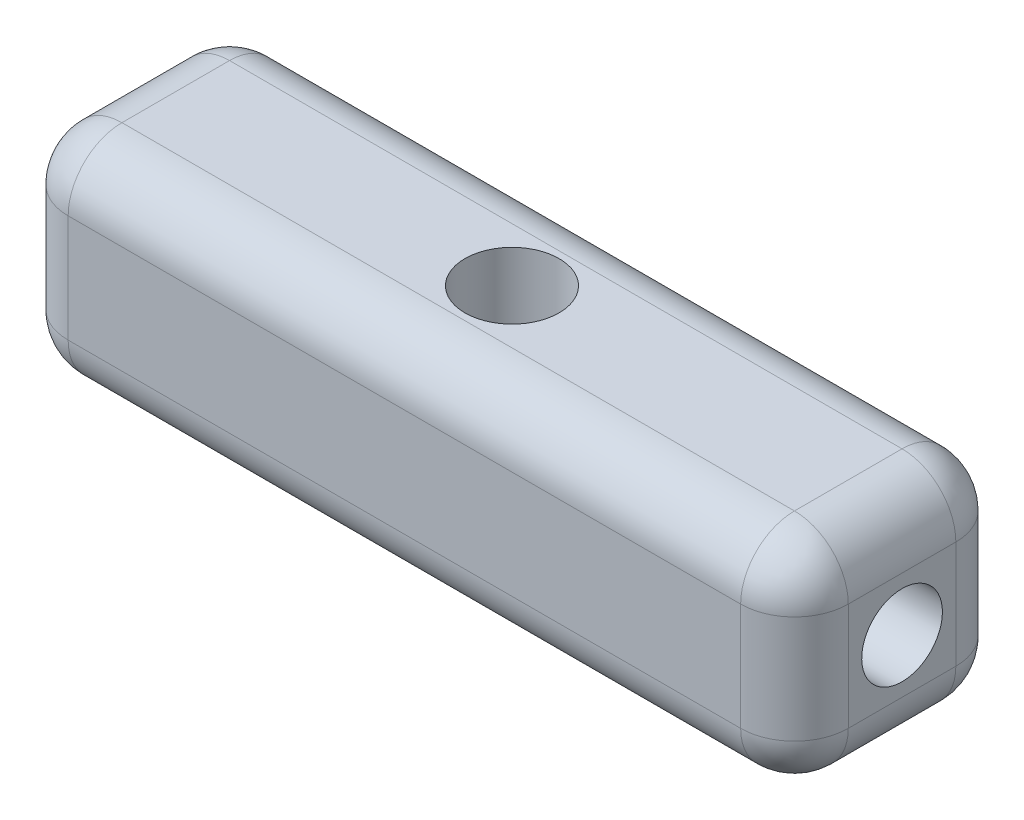
ISO-10303-21;
HEADER;
FILE_DESCRIPTION(('STEP AP214'),'2;1');
FILE_NAME('part.step','',(''),(''),'','','');
FILE_SCHEMA(('AUTOMOTIVE_DESIGN { 1 0 10303 214 1 1 1 1 }'));
ENDSEC;
DATA;
#1=APPLICATION_CONTEXT('core data for automotive mechanical design processes');
#2=APPLICATION_PROTOCOL_DEFINITION('international standard','automotive_design',2000,#1);
#3=PRODUCT_CONTEXT('',#1,'mechanical');
#4=PRODUCT('Part','Part','',(#3));
#5=PRODUCT_RELATED_PRODUCT_CATEGORY('part','',(#4));
#6=PRODUCT_DEFINITION_FORMATION('','',#4);
#7=PRODUCT_DEFINITION_CONTEXT('part definition',#1,'design');
#8=PRODUCT_DEFINITION('design','',#6,#7);
#9=PRODUCT_DEFINITION_SHAPE('','',#8);
#10=(LENGTH_UNIT() NAMED_UNIT(*) SI_UNIT(.MILLI.,.METRE.));
#11=(NAMED_UNIT(*) PLANE_ANGLE_UNIT() SI_UNIT($,.RADIAN.));
#12=(NAMED_UNIT(*) SI_UNIT($,.STERADIAN.) SOLID_ANGLE_UNIT());
#13=UNCERTAINTY_MEASURE_WITH_UNIT(LENGTH_MEASURE(1.E-05),#10,'distance_accuracy_value','');
#14=(GEOMETRIC_REPRESENTATION_CONTEXT(3) GLOBAL_UNCERTAINTY_ASSIGNED_CONTEXT((#13)) GLOBAL_UNIT_ASSIGNED_CONTEXT((#10,
#11,#12)) REPRESENTATION_CONTEXT('',''));
#15=CARTESIAN_POINT('',(0.,0.,0.));
#16=DIRECTION('',(0.,0.,1.));
#17=DIRECTION('',(1.,0.,0.));
#18=AXIS2_PLACEMENT_3D('',#15,#16,#17);
#19=CARTESIAN_POINT('',(0.,0.,8.));
#20=DIRECTION('',(1.,0.,0.));
#21=DIRECTION('',(0.,0.,-1.));
#22=AXIS2_PLACEMENT_3D('',#19,#20,#21);
#23=PLANE('',#22);
#24=CARTESIAN_POINT('',(0.,4.,4.));
#25=DIRECTION('',(-1.,0.,0.));
#26=DIRECTION('',(0.,0.,1.));
#27=AXIS2_PLACEMENT_3D('',#24,#25,#26);
#28=CIRCLE('',#27,1.5);
#29=CARTESIAN_POINT('',(0.,4.,5.5));
#30=VERTEX_POINT('',#29);
#31=EDGE_CURVE('E665',#30,#30,#28,.T.);
#32=ORIENTED_EDGE('',*,*,#31,.F.);
#33=EDGE_LOOP('',(#32));
#34=FACE_BOUND('',#33,.T.);
#35=DIRECTION('',(0.,-1.,0.));
#36=VECTOR('',#35,1.);
#37=CARTESIAN_POINT('',(0.,0.,2.));
#38=LINE('',#37,#36);
#39=CARTESIAN_POINT('',(0.,6.,2.));
#40=VERTEX_POINT('',#39);
#41=CARTESIAN_POINT('',(0.,2.,2.));
#42=VERTEX_POINT('',#41);
#43=EDGE_CURVE('E207',#40,#42,#38,.T.);
#44=ORIENTED_EDGE('',*,*,#43,.T.);
#45=DIRECTION('',(0.,0.,-1.));
#46=VECTOR('',#45,1.);
#47=CARTESIAN_POINT('',(0.,2.,8.));
#48=LINE('',#47,#46);
#49=CARTESIAN_POINT('',(0.,2.,6.));
#50=VERTEX_POINT('',#49);
#51=EDGE_CURVE('E12',#42,#50,#48,.F.);
#52=ORIENTED_EDGE('',*,*,#51,.T.);
#53=DIRECTION('',(0.,-1.,0.));
#54=VECTOR('',#53,1.);
#55=CARTESIAN_POINT('',(0.,0.,6.));
#56=LINE('',#55,#54);
#57=CARTESIAN_POINT('',(0.,6.,6.));
#58=VERTEX_POINT('',#57);
#59=EDGE_CURVE('E49',#50,#58,#56,.F.);
#60=ORIENTED_EDGE('',*,*,#59,.T.);
#61=DIRECTION('',(0.,0.,-1.));
#62=VECTOR('',#61,1.);
#63=CARTESIAN_POINT('',(0.,6.,8.));
#64=LINE('',#63,#62);
#65=EDGE_CURVE('E209',#58,#40,#64,.T.);
#66=ORIENTED_EDGE('',*,*,#65,.T.);
#67=EDGE_LOOP('',(#44,#52,#60,#66));
#68=FACE_BOUND('',#67,.T.);
#69=ADVANCED_FACE('F40',(#34,#68),#23,.F.);
#70=CARTESIAN_POINT('',(0.,0.,8.));
#71=DIRECTION('',(0.,1.,0.));
#72=DIRECTION('',(0.,0.,1.));
#73=AXIS2_PLACEMENT_3D('',#70,#71,#72);
#74=PLANE('',#73);
#75=DIRECTION('',(0.,0.,-1.));
#76=VECTOR('',#75,1.);
#77=CARTESIAN_POINT('',(2.,0.,8.));
#78=LINE('',#77,#76);
#79=CARTESIAN_POINT('',(2.,0.,6.));
#80=VERTEX_POINT('',#79);
#81=CARTESIAN_POINT('',(2.,0.,2.));
#82=VERTEX_POINT('',#81);
#83=EDGE_CURVE('E171',#80,#82,#78,.T.);
#84=ORIENTED_EDGE('',*,*,#83,.T.);
#85=DIRECTION('',(1.,0.,0.));
#86=VECTOR('',#85,1.);
#87=CARTESIAN_POINT('',(29.,0.,2.));
#88=LINE('',#87,#86);
#89=CARTESIAN_POINT('',(27.,0.,2.));
#90=VERTEX_POINT('',#89);
#91=EDGE_CURVE('E178',#82,#90,#88,.T.);
#92=ORIENTED_EDGE('',*,*,#91,.T.);
#93=DIRECTION('',(0.,0.,-1.));
#94=VECTOR('',#93,1.);
#95=CARTESIAN_POINT('',(27.,0.,8.));
#96=LINE('',#95,#94);
#97=CARTESIAN_POINT('',(27.,0.,6.));
#98=VERTEX_POINT('',#97);
#99=EDGE_CURVE('E139',#90,#98,#96,.F.);
#100=ORIENTED_EDGE('',*,*,#99,.T.);
#101=DIRECTION('',(1.,0.,0.));
#102=VECTOR('',#101,1.);
#103=CARTESIAN_POINT('',(0.,0.,6.));
#104=LINE('',#103,#102);
#105=EDGE_CURVE('E169',#98,#80,#104,.F.);
#106=ORIENTED_EDGE('',*,*,#105,.T.);
#107=EDGE_LOOP('',(#84,#92,#100,#106));
#108=FACE_BOUND('',#107,.T.);
#109=CARTESIAN_POINT('',(14.5,0.,4.));
#110=DIRECTION('',(0.,1.,0.));
#111=DIRECTION('',(0.,0.,1.));
#112=AXIS2_PLACEMENT_3D('',#109,#110,#111);
#113=CIRCLE('',#112,1.75);
#114=CARTESIAN_POINT('',(14.5,0.,5.75));
#115=VERTEX_POINT('',#114);
#116=EDGE_CURVE('E163',#115,#115,#113,.T.);
#117=ORIENTED_EDGE('',*,*,#116,.T.);
#118=EDGE_LOOP('',(#117));
#119=FACE_BOUND('',#118,.T.);
#120=ADVANCED_FACE('F301',(#108,#119),#74,.F.);
#121=CARTESIAN_POINT('',(29.,0.,8.));
#122=DIRECTION('',(-1.,0.,0.));
#123=DIRECTION('',(0.,0.,1.));
#124=AXIS2_PLACEMENT_3D('',#121,#122,#123);
#125=PLANE('',#124);
#126=CARTESIAN_POINT('',(29.,4.,4.));
#127=DIRECTION('',(1.,0.,0.));
#128=DIRECTION('',(0.,1.,0.));
#129=AXIS2_PLACEMENT_3D('',#126,#127,#128);
#130=CIRCLE('',#129,1.5);
#131=CARTESIAN_POINT('',(29.,5.5,4.));
#132=VERTEX_POINT('',#131);
#133=EDGE_CURVE('E659',#132,#132,#130,.T.);
#134=ORIENTED_EDGE('',*,*,#133,.F.);
#135=EDGE_LOOP('',(#134));
#136=FACE_BOUND('',#135,.T.);
#137=DIRECTION('',(0.,1.,0.));
#138=VECTOR('',#137,1.);
#139=CARTESIAN_POINT('',(29.,0.,6.));
#140=LINE('',#139,#138);
#141=CARTESIAN_POINT('',(29.,6.,6.));
#142=VERTEX_POINT('',#141);
#143=CARTESIAN_POINT('',(29.,2.,6.));
#144=VERTEX_POINT('',#143);
#145=EDGE_CURVE('E167',#142,#144,#140,.F.);
#146=ORIENTED_EDGE('',*,*,#145,.T.);
#147=DIRECTION('',(0.,0.,-1.));
#148=VECTOR('',#147,1.);
#149=CARTESIAN_POINT('',(29.,2.,8.));
#150=LINE('',#149,#148);
#151=CARTESIAN_POINT('',(29.,2.,2.));
#152=VERTEX_POINT('',#151);
#153=EDGE_CURVE('E137',#144,#152,#150,.T.);
#154=ORIENTED_EDGE('',*,*,#153,.T.);
#155=DIRECTION('',(0.,1.,0.));
#156=VECTOR('',#155,1.);
#157=CARTESIAN_POINT('',(29.,8.,2.));
#158=LINE('',#157,#156);
#159=CARTESIAN_POINT('',(29.,6.,2.));
#160=VERTEX_POINT('',#159);
#161=EDGE_CURVE('E156',#152,#160,#158,.T.);
#162=ORIENTED_EDGE('',*,*,#161,.T.);
#163=DIRECTION('',(0.,0.,-1.));
#164=VECTOR('',#163,1.);
#165=CARTESIAN_POINT('',(29.,6.,8.));
#166=LINE('',#165,#164);
#167=EDGE_CURVE('E162',#160,#142,#166,.F.);
#168=ORIENTED_EDGE('',*,*,#167,.T.);
#169=EDGE_LOOP('',(#146,#154,#162,#168));
#170=FACE_BOUND('',#169,.T.);
#171=ADVANCED_FACE('F165',(#136,#170),#125,.F.);
#172=CARTESIAN_POINT('',(0.,8.,8.));
#173=DIRECTION('',(0.,-1.,0.));
#174=DIRECTION('',(0.,0.,-1.));
#175=AXIS2_PLACEMENT_3D('',#172,#173,#174);
#176=PLANE('',#175);
#177=DIRECTION('',(0.,0.,-1.));
#178=VECTOR('',#177,1.);
#179=CARTESIAN_POINT('',(27.,8.,8.));
#180=LINE('',#179,#178);
#181=CARTESIAN_POINT('',(27.,8.,6.));
#182=VERTEX_POINT('',#181);
#183=CARTESIAN_POINT('',(27.,8.,2.));
#184=VERTEX_POINT('',#183);
#185=EDGE_CURVE('E193',#182,#184,#180,.T.);
#186=ORIENTED_EDGE('',*,*,#185,.T.);
#187=DIRECTION('',(-1.,0.,0.));
#188=VECTOR('',#187,1.);
#189=CARTESIAN_POINT('',(0.,8.,2.));
#190=LINE('',#189,#188);
#191=CARTESIAN_POINT('',(2.,8.,2.));
#192=VERTEX_POINT('',#191);
#193=EDGE_CURVE('E196',#184,#192,#190,.T.);
#194=ORIENTED_EDGE('',*,*,#193,.T.);
#195=DIRECTION('',(0.,0.,-1.));
#196=VECTOR('',#195,1.);
#197=CARTESIAN_POINT('',(2.,8.,8.));
#198=LINE('',#197,#196);
#199=CARTESIAN_POINT('',(2.,8.,6.));
#200=VERTEX_POINT('',#199);
#201=EDGE_CURVE('E191',#192,#200,#198,.F.);
#202=ORIENTED_EDGE('',*,*,#201,.T.);
#203=DIRECTION('',(-1.,0.,0.));
#204=VECTOR('',#203,1.);
#205=CARTESIAN_POINT('',(0.,8.,6.));
#206=LINE('',#205,#204);
#207=EDGE_CURVE('E189',#200,#182,#206,.F.);
#208=ORIENTED_EDGE('',*,*,#207,.T.);
#209=EDGE_LOOP('',(#186,#194,#202,#208));
#210=FACE_BOUND('',#209,.T.);
#211=CARTESIAN_POINT('',(14.5,8.,4.));
#212=DIRECTION('',(0.,1.,0.));
#213=DIRECTION('',(0.,0.,1.));
#214=AXIS2_PLACEMENT_3D('',#211,#212,#213);
#215=CIRCLE('',#214,1.75);
#216=CARTESIAN_POINT('',(14.5,8.,5.75));
#217=VERTEX_POINT('',#216);
#218=EDGE_CURVE('E266',#217,#217,#215,.T.);
#219=ORIENTED_EDGE('',*,*,#218,.F.);
#220=EDGE_LOOP('',(#219));
#221=FACE_BOUND('',#220,.T.);
#222=ADVANCED_FACE('F606',(#210,#221),#176,.F.);
#223=CARTESIAN_POINT('',(0.,0.,8.));
#224=DIRECTION('',(0.,0.,-1.));
#225=DIRECTION('',(-1.,0.,0.));
#226=AXIS2_PLACEMENT_3D('',#223,#224,#225);
#227=PLANE('',#226);
#228=DIRECTION('',(0.,-1.,0.));
#229=VECTOR('',#228,1.);
#230=CARTESIAN_POINT('',(2.,0.,8.));
#231=LINE('',#230,#229);
#232=CARTESIAN_POINT('',(2.,6.,8.));
#233=VERTEX_POINT('',#232);
#234=CARTESIAN_POINT('',(2.,2.,8.));
#235=VERTEX_POINT('',#234);
#236=EDGE_CURVE('E182',#233,#235,#231,.T.);
#237=ORIENTED_EDGE('',*,*,#236,.T.);
#238=DIRECTION('',(1.,0.,0.));
#239=VECTOR('',#238,1.);
#240=CARTESIAN_POINT('',(0.,2.,8.));
#241=LINE('',#240,#239);
#242=CARTESIAN_POINT('',(27.,2.,8.));
#243=VERTEX_POINT('',#242);
#244=EDGE_CURVE('E187',#235,#243,#241,.T.);
#245=ORIENTED_EDGE('',*,*,#244,.T.);
#246=DIRECTION('',(0.,1.,0.));
#247=VECTOR('',#246,1.);
#248=CARTESIAN_POINT('',(27.,0.,8.));
#249=LINE('',#248,#247);
#250=CARTESIAN_POINT('',(27.,6.,8.));
#251=VERTEX_POINT('',#250);
#252=EDGE_CURVE('E184',#243,#251,#249,.T.);
#253=ORIENTED_EDGE('',*,*,#252,.T.);
#254=DIRECTION('',(-1.,0.,0.));
#255=VECTOR('',#254,1.);
#256=CARTESIAN_POINT('',(0.,6.,8.));
#257=LINE('',#256,#255);
#258=EDGE_CURVE('E180',#251,#233,#257,.T.);
#259=ORIENTED_EDGE('',*,*,#258,.T.);
#260=EDGE_LOOP('',(#237,#245,#253,#259));
#261=FACE_BOUND('',#260,.T.);
#262=ADVANCED_FACE('F596',(#261),#227,.F.);
#263=CARTESIAN_POINT('',(0.,0.,0.));
#264=DIRECTION('',(0.,0.,-1.));
#265=DIRECTION('',(-1.,0.,0.));
#266=AXIS2_PLACEMENT_3D('',#263,#264,#265);
#267=PLANE('',#266);
#268=DIRECTION('',(0.,1.,0.));
#269=VECTOR('',#268,1.);
#270=CARTESIAN_POINT('',(27.,0.,0.));
#271=LINE('',#270,#269);
#272=CARTESIAN_POINT('',(27.,6.,0.));
#273=VERTEX_POINT('',#272);
#274=CARTESIAN_POINT('',(27.,2.,0.));
#275=VERTEX_POINT('',#274);
#276=EDGE_CURVE('E202',#273,#275,#271,.F.);
#277=ORIENTED_EDGE('',*,*,#276,.T.);
#278=DIRECTION('',(1.,0.,0.));
#279=VECTOR('',#278,1.);
#280=CARTESIAN_POINT('',(0.,2.,0.));
#281=LINE('',#280,#279);
#282=CARTESIAN_POINT('',(2.,2.,0.));
#283=VERTEX_POINT('',#282);
#284=EDGE_CURVE('E205',#275,#283,#281,.F.);
#285=ORIENTED_EDGE('',*,*,#284,.T.);
#286=DIRECTION('',(0.,-1.,0.));
#287=VECTOR('',#286,1.);
#288=CARTESIAN_POINT('',(2.,8.,0.));
#289=LINE('',#288,#287);
#290=CARTESIAN_POINT('',(2.,6.,0.));
#291=VERTEX_POINT('',#290);
#292=EDGE_CURVE('E200',#283,#291,#289,.F.);
#293=ORIENTED_EDGE('',*,*,#292,.T.);
#294=DIRECTION('',(-1.,0.,0.));
#295=VECTOR('',#294,1.);
#296=CARTESIAN_POINT('',(29.,6.,0.));
#297=LINE('',#296,#295);
#298=EDGE_CURVE('E198',#291,#273,#297,.F.);
#299=ORIENTED_EDGE('',*,*,#298,.T.);
#300=EDGE_LOOP('',(#277,#285,#293,#299));
#301=FACE_BOUND('',#300,.T.);
#302=ADVANCED_FACE('F310',(#301),#267,.T.);
#303=CARTESIAN_POINT('',(14.5,0.,4.));
#304=DIRECTION('',(0.,1.,0.));
#305=DIRECTION('',(0.,0.,1.));
#306=AXIS2_PLACEMENT_3D('',#303,#304,#305);
#307=CYLINDRICAL_SURFACE('',#306,1.75);
#308=ORIENTED_EDGE('',*,*,#116,.F.);
#309=EDGE_LOOP('',(#308));
#310=FACE_BOUND('',#309,.T.);
#311=ORIENTED_EDGE('',*,*,#218,.T.);
#312=EDGE_LOOP('',(#311));
#313=FACE_BOUND('',#312,.T.);
#314=ADVANCED_FACE('F575',(#310,#313),#307,.F.);
#315=CARTESIAN_POINT('',(2.,6.,8.));
#316=DIRECTION('',(0.,0.,-1.));
#317=DIRECTION('',(-1.,0.,0.));
#318=AXIS2_PLACEMENT_3D('',#315,#316,#317);
#319=CYLINDRICAL_SURFACE('',#318,2.);
#320=CARTESIAN_POINT('',(2.,6.,6.));
#321=DIRECTION('',(0.,0.,1.));
#322=DIRECTION('',(1.,0.,0.));
#323=AXIS2_PLACEMENT_3D('',#320,#321,#322);
#324=CIRCLE('',#323,2.);
#325=EDGE_CURVE('E44',#200,#58,#324,.T.);
#326=ORIENTED_EDGE('',*,*,#325,.F.);
#327=ORIENTED_EDGE('',*,*,#201,.F.);
#328=CARTESIAN_POINT('',(2.,6.,2.));
#329=DIRECTION('',(0.,0.,-1.));
#330=DIRECTION('',(-1.,0.,0.));
#331=AXIS2_PLACEMENT_3D('',#328,#329,#330);
#332=CIRCLE('',#331,2.);
#333=EDGE_CURVE('E259',#40,#192,#332,.T.);
#334=ORIENTED_EDGE('',*,*,#333,.F.);
#335=ORIENTED_EDGE('',*,*,#65,.F.);
#336=EDGE_LOOP('',(#326,#327,#334,#335));
#337=FACE_BOUND('',#336,.T.);
#338=ADVANCED_FACE('F42',(#337),#319,.T.);
#339=CARTESIAN_POINT('',(2.,6.,6.));
#340=DIRECTION('',(-1.,0.,0.));
#341=DIRECTION('',(0.,0.,1.));
#342=AXIS2_PLACEMENT_3D('',#339,#340,#341);
#343=SPHERICAL_SURFACE('',#342,2.);
#344=CARTESIAN_POINT('',(2.,6.,6.));
#345=DIRECTION('',(-1.,0.,0.));
#346=DIRECTION('',(0.,0.,1.));
#347=AXIS2_PLACEMENT_3D('',#344,#345,#346);
#348=CIRCLE('',#347,2.);
#349=EDGE_CURVE('E254',#200,#233,#348,.F.);
#350=ORIENTED_EDGE('',*,*,#349,.F.);
#351=ORIENTED_EDGE('',*,*,#325,.T.);
#352=CARTESIAN_POINT('',(2.,6.,6.));
#353=DIRECTION('',(0.,1.,0.));
#354=DIRECTION('',(0.,0.,1.));
#355=AXIS2_PLACEMENT_3D('',#352,#353,#354);
#356=CIRCLE('',#355,2.);
#357=EDGE_CURVE('E257',#233,#58,#356,.F.);
#358=ORIENTED_EDGE('',*,*,#357,.F.);
#359=EDGE_LOOP('',(#350,#351,#358));
#360=FACE_BOUND('',#359,.T.);
#361=ADVANCED_FACE('F557',(#360),#343,.T.);
#362=CARTESIAN_POINT('',(2.,6.,2.));
#363=DIRECTION('',(0.,1.,0.));
#364=DIRECTION('',(0.,0.,1.));
#365=AXIS2_PLACEMENT_3D('',#362,#363,#364);
#366=SPHERICAL_SURFACE('',#365,2.);
#367=CARTESIAN_POINT('',(2.,6.,2.));
#368=DIRECTION('',(0.,1.,0.));
#369=DIRECTION('',(0.,0.,1.));
#370=AXIS2_PLACEMENT_3D('',#367,#368,#369);
#371=CIRCLE('',#370,2.);
#372=EDGE_CURVE('E248',#40,#291,#371,.F.);
#373=ORIENTED_EDGE('',*,*,#372,.F.);
#374=ORIENTED_EDGE('',*,*,#333,.T.);
#375=CARTESIAN_POINT('',(2.,6.,2.));
#376=DIRECTION('',(-1.,0.,0.));
#377=DIRECTION('',(0.,0.,1.));
#378=AXIS2_PLACEMENT_3D('',#375,#376,#377);
#379=CIRCLE('',#378,2.);
#380=EDGE_CURVE('E251',#291,#192,#379,.F.);
#381=ORIENTED_EDGE('',*,*,#380,.F.);
#382=EDGE_LOOP('',(#373,#374,#381));
#383=FACE_BOUND('',#382,.T.);
#384=ADVANCED_FACE('F546',(#383),#366,.T.);
#385=CARTESIAN_POINT('',(2.,0.,6.));
#386=DIRECTION('',(0.,-1.,0.));
#387=DIRECTION('',(0.,0.,-1.));
#388=AXIS2_PLACEMENT_3D('',#385,#386,#387);
#389=CYLINDRICAL_SURFACE('',#388,2.);
#390=ORIENTED_EDGE('',*,*,#357,.T.);
#391=ORIENTED_EDGE('',*,*,#59,.F.);
#392=CARTESIAN_POINT('',(2.,2.,6.));
#393=DIRECTION('',(0.,-1.,0.));
#394=DIRECTION('',(0.,0.,-1.));
#395=AXIS2_PLACEMENT_3D('',#392,#393,#394);
#396=CIRCLE('',#395,2.);
#397=EDGE_CURVE('E57',#235,#50,#396,.T.);
#398=ORIENTED_EDGE('',*,*,#397,.F.);
#399=ORIENTED_EDGE('',*,*,#236,.F.);
#400=EDGE_LOOP('',(#390,#391,#398,#399));
#401=FACE_BOUND('',#400,.T.);
#402=ADVANCED_FACE('F535',(#401),#389,.T.);
#403=CARTESIAN_POINT('',(0.,6.,6.));
#404=DIRECTION('',(-1.,0.,0.));
#405=DIRECTION('',(0.,0.,1.));
#406=AXIS2_PLACEMENT_3D('',#403,#404,#405);
#407=CYLINDRICAL_SURFACE('',#406,2.);
#408=ORIENTED_EDGE('',*,*,#349,.T.);
#409=ORIENTED_EDGE('',*,*,#258,.F.);
#410=CARTESIAN_POINT('',(27.,6.,6.));
#411=DIRECTION('',(1.,0.,0.));
#412=DIRECTION('',(0.,0.,-1.));
#413=AXIS2_PLACEMENT_3D('',#410,#411,#412);
#414=CIRCLE('',#413,2.);
#415=EDGE_CURVE('E242',#182,#251,#414,.T.);
#416=ORIENTED_EDGE('',*,*,#415,.F.);
#417=ORIENTED_EDGE('',*,*,#207,.F.);
#418=EDGE_LOOP('',(#408,#409,#416,#417));
#419=FACE_BOUND('',#418,.T.);
#420=ADVANCED_FACE('F525',(#419),#407,.T.);
#421=CARTESIAN_POINT('',(27.,6.,8.));
#422=DIRECTION('',(0.,0.,-1.));
#423=DIRECTION('',(-1.,0.,0.));
#424=AXIS2_PLACEMENT_3D('',#421,#422,#423);
#425=CYLINDRICAL_SURFACE('',#424,2.);
#426=CARTESIAN_POINT('',(27.,6.,2.));
#427=DIRECTION('',(0.,0.,-1.));
#428=DIRECTION('',(-1.,0.,0.));
#429=AXIS2_PLACEMENT_3D('',#426,#427,#428);
#430=CIRCLE('',#429,2.);
#431=EDGE_CURVE('E236',#184,#160,#430,.T.);
#432=ORIENTED_EDGE('',*,*,#431,.F.);
#433=ORIENTED_EDGE('',*,*,#185,.F.);
#434=CARTESIAN_POINT('',(27.,6.,6.));
#435=DIRECTION('',(0.,0.,1.));
#436=DIRECTION('',(1.,0.,0.));
#437=AXIS2_PLACEMENT_3D('',#434,#435,#436);
#438=CIRCLE('',#437,2.);
#439=EDGE_CURVE('E239',#142,#182,#438,.T.);
#440=ORIENTED_EDGE('',*,*,#439,.F.);
#441=ORIENTED_EDGE('',*,*,#167,.F.);
#442=EDGE_LOOP('',(#432,#433,#440,#441));
#443=FACE_BOUND('',#442,.T.);
#444=ADVANCED_FACE('F283',(#443),#425,.T.);
#445=CARTESIAN_POINT('',(0.,6.,2.));
#446=DIRECTION('',(1.,0.,0.));
#447=DIRECTION('',(0.,0.,-1.));
#448=AXIS2_PLACEMENT_3D('',#445,#446,#447);
#449=CYLINDRICAL_SURFACE('',#448,2.);
#450=ORIENTED_EDGE('',*,*,#380,.T.);
#451=ORIENTED_EDGE('',*,*,#193,.F.);
#452=CARTESIAN_POINT('',(27.,6.,2.));
#453=DIRECTION('',(1.,0.,0.));
#454=DIRECTION('',(0.,0.,-1.));
#455=AXIS2_PLACEMENT_3D('',#452,#453,#454);
#456=CIRCLE('',#455,2.);
#457=EDGE_CURVE('E234',#273,#184,#456,.T.);
#458=ORIENTED_EDGE('',*,*,#457,.F.);
#459=ORIENTED_EDGE('',*,*,#298,.F.);
#460=EDGE_LOOP('',(#450,#451,#458,#459));
#461=FACE_BOUND('',#460,.T.);
#462=ADVANCED_FACE('F315',(#461),#449,.T.);
#463=CARTESIAN_POINT('',(2.,0.,2.));
#464=DIRECTION('',(0.,1.,0.));
#465=DIRECTION('',(0.,0.,1.));
#466=AXIS2_PLACEMENT_3D('',#463,#464,#465);
#467=CYLINDRICAL_SURFACE('',#466,2.);
#468=ORIENTED_EDGE('',*,*,#372,.T.);
#469=ORIENTED_EDGE('',*,*,#292,.F.);
#470=CARTESIAN_POINT('',(2.,2.,2.));
#471=DIRECTION('',(0.,-1.,0.));
#472=DIRECTION('',(0.,0.,-1.));
#473=AXIS2_PLACEMENT_3D('',#470,#471,#472);
#474=CIRCLE('',#473,2.);
#475=EDGE_CURVE('E231',#42,#283,#474,.T.);
#476=ORIENTED_EDGE('',*,*,#475,.F.);
#477=ORIENTED_EDGE('',*,*,#43,.F.);
#478=EDGE_LOOP('',(#468,#469,#476,#477));
#479=FACE_BOUND('',#478,.T.);
#480=ADVANCED_FACE('F495',(#479),#467,.T.);
#481=CARTESIAN_POINT('',(2.,2.,8.));
#482=DIRECTION('',(0.,0.,-1.));
#483=DIRECTION('',(-1.,0.,0.));
#484=AXIS2_PLACEMENT_3D('',#481,#482,#483);
#485=CYLINDRICAL_SURFACE('',#484,2.);
#486=CARTESIAN_POINT('',(2.,2.,6.));
#487=DIRECTION('',(0.,0.,1.));
#488=DIRECTION('',(1.,0.,0.));
#489=AXIS2_PLACEMENT_3D('',#486,#487,#488);
#490=CIRCLE('',#489,2.);
#491=EDGE_CURVE('E246',#50,#80,#490,.T.);
#492=ORIENTED_EDGE('',*,*,#491,.F.);
#493=ORIENTED_EDGE('',*,*,#51,.F.);
#494=CARTESIAN_POINT('',(2.,2.,2.));
#495=DIRECTION('',(0.,0.,-1.));
#496=DIRECTION('',(-1.,0.,0.));
#497=AXIS2_PLACEMENT_3D('',#494,#495,#496);
#498=CIRCLE('',#497,2.);
#499=EDGE_CURVE('E228',#82,#42,#498,.T.);
#500=ORIENTED_EDGE('',*,*,#499,.F.);
#501=ORIENTED_EDGE('',*,*,#83,.F.);
#502=EDGE_LOOP('',(#492,#493,#500,#501));
#503=FACE_BOUND('',#502,.T.);
#504=ADVANCED_FACE('F485',(#503),#485,.T.);
#505=CARTESIAN_POINT('',(2.,2.,6.));
#506=DIRECTION('',(-1.,0.,0.));
#507=DIRECTION('',(0.,0.,1.));
#508=AXIS2_PLACEMENT_3D('',#505,#506,#507);
#509=SPHERICAL_SURFACE('',#508,2.);
#510=ORIENTED_EDGE('',*,*,#397,.T.);
#511=ORIENTED_EDGE('',*,*,#491,.T.);
#512=CARTESIAN_POINT('',(2.,2.,6.));
#513=DIRECTION('',(-1.,0.,0.));
#514=DIRECTION('',(0.,0.,1.));
#515=AXIS2_PLACEMENT_3D('',#512,#513,#514);
#516=CIRCLE('',#515,2.);
#517=EDGE_CURVE('E225',#235,#80,#516,.F.);
#518=ORIENTED_EDGE('',*,*,#517,.F.);
#519=EDGE_LOOP('',(#510,#511,#518));
#520=FACE_BOUND('',#519,.T.);
#521=ADVANCED_FACE('F327',(#520),#509,.T.);
#522=CARTESIAN_POINT('',(27.,6.,6.));
#523=DIRECTION('',(0.,1.,0.));
#524=DIRECTION('',(0.,0.,1.));
#525=AXIS2_PLACEMENT_3D('',#522,#523,#524);
#526=SPHERICAL_SURFACE('',#525,2.);
#527=ORIENTED_EDGE('',*,*,#439,.T.);
#528=ORIENTED_EDGE('',*,*,#415,.T.);
#529=CARTESIAN_POINT('',(27.,6.,6.));
#530=DIRECTION('',(0.,1.,0.));
#531=DIRECTION('',(0.,0.,1.));
#532=AXIS2_PLACEMENT_3D('',#529,#530,#531);
#533=CIRCLE('',#532,2.);
#534=EDGE_CURVE('E223',#142,#251,#533,.F.);
#535=ORIENTED_EDGE('',*,*,#534,.F.);
#536=EDGE_LOOP('',(#527,#528,#535));
#537=FACE_BOUND('',#536,.T.);
#538=ADVANCED_FACE('F286',(#537),#526,.T.);
#539=CARTESIAN_POINT('',(27.,6.,2.));
#540=DIRECTION('',(0.,1.,0.));
#541=DIRECTION('',(0.,0.,1.));
#542=AXIS2_PLACEMENT_3D('',#539,#540,#541);
#543=SPHERICAL_SURFACE('',#542,2.);
#544=ORIENTED_EDGE('',*,*,#457,.T.);
#545=ORIENTED_EDGE('',*,*,#431,.T.);
#546=CARTESIAN_POINT('',(27.,6.,2.));
#547=DIRECTION('',(0.,1.,0.));
#548=DIRECTION('',(0.,0.,1.));
#549=AXIS2_PLACEMENT_3D('',#546,#547,#548);
#550=CIRCLE('',#549,2.);
#551=EDGE_CURVE('E159',#273,#160,#550,.F.);
#552=ORIENTED_EDGE('',*,*,#551,.F.);
#553=EDGE_LOOP('',(#544,#545,#552));
#554=FACE_BOUND('',#553,.T.);
#555=ADVANCED_FACE('F317',(#554),#543,.T.);
#556=CARTESIAN_POINT('',(2.,2.,2.));
#557=DIRECTION('',(-1.,0.,0.));
#558=DIRECTION('',(0.,0.,1.));
#559=AXIS2_PLACEMENT_3D('',#556,#557,#558);
#560=SPHERICAL_SURFACE('',#559,2.);
#561=ORIENTED_EDGE('',*,*,#499,.T.);
#562=ORIENTED_EDGE('',*,*,#475,.T.);
#563=CARTESIAN_POINT('',(2.,2.,2.));
#564=DIRECTION('',(-1.,0.,0.));
#565=DIRECTION('',(0.,0.,1.));
#566=AXIS2_PLACEMENT_3D('',#563,#564,#565);
#567=CIRCLE('',#566,2.);
#568=EDGE_CURVE('E219',#82,#283,#567,.F.);
#569=ORIENTED_EDGE('',*,*,#568,.F.);
#570=EDGE_LOOP('',(#561,#562,#569));
#571=FACE_BOUND('',#570,.T.);
#572=ADVANCED_FACE('F319',(#571),#560,.T.);
#573=CARTESIAN_POINT('',(0.,2.,6.));
#574=DIRECTION('',(1.,0.,0.));
#575=DIRECTION('',(0.,0.,-1.));
#576=AXIS2_PLACEMENT_3D('',#573,#574,#575);
#577=CYLINDRICAL_SURFACE('',#576,2.);
#578=ORIENTED_EDGE('',*,*,#517,.T.);
#579=ORIENTED_EDGE('',*,*,#105,.F.);
#580=CARTESIAN_POINT('',(27.,2.,6.));
#581=DIRECTION('',(1.,0.,0.));
#582=DIRECTION('',(0.,0.,-1.));
#583=AXIS2_PLACEMENT_3D('',#580,#581,#582);
#584=CIRCLE('',#583,2.);
#585=EDGE_CURVE('E216',#243,#98,#584,.T.);
#586=ORIENTED_EDGE('',*,*,#585,.F.);
#587=ORIENTED_EDGE('',*,*,#244,.F.);
#588=EDGE_LOOP('',(#578,#579,#586,#587));
#589=FACE_BOUND('',#588,.T.);
#590=ADVANCED_FACE('F298',(#589),#577,.T.);
#591=CARTESIAN_POINT('',(27.,0.,6.));
#592=DIRECTION('',(0.,1.,0.));
#593=DIRECTION('',(0.,0.,1.));
#594=AXIS2_PLACEMENT_3D('',#591,#592,#593);
#595=CYLINDRICAL_SURFACE('',#594,2.);
#596=ORIENTED_EDGE('',*,*,#534,.T.);
#597=ORIENTED_EDGE('',*,*,#252,.F.);
#598=CARTESIAN_POINT('',(27.,2.,6.));
#599=DIRECTION('',(0.,-1.,0.));
#600=DIRECTION('',(0.,0.,-1.));
#601=AXIS2_PLACEMENT_3D('',#598,#599,#600);
#602=CIRCLE('',#601,2.);
#603=EDGE_CURVE('E153',#144,#243,#602,.T.);
#604=ORIENTED_EDGE('',*,*,#603,.F.);
#605=ORIENTED_EDGE('',*,*,#145,.F.);
#606=EDGE_LOOP('',(#596,#597,#604,#605));
#607=FACE_BOUND('',#606,.T.);
#608=ADVANCED_FACE('F290',(#607),#595,.T.);
#609=CARTESIAN_POINT('',(27.,0.,2.));
#610=DIRECTION('',(0.,-1.,0.));
#611=DIRECTION('',(0.,0.,-1.));
#612=AXIS2_PLACEMENT_3D('',#609,#610,#611);
#613=CYLINDRICAL_SURFACE('',#612,2.);
#614=ORIENTED_EDGE('',*,*,#551,.T.);
#615=ORIENTED_EDGE('',*,*,#161,.F.);
#616=CARTESIAN_POINT('',(27.,2.,2.));
#617=DIRECTION('',(0.,-1.,0.));
#618=DIRECTION('',(0.,0.,-1.));
#619=AXIS2_PLACEMENT_3D('',#616,#617,#618);
#620=CIRCLE('',#619,2.);
#621=EDGE_CURVE('E145',#275,#152,#620,.T.);
#622=ORIENTED_EDGE('',*,*,#621,.F.);
#623=ORIENTED_EDGE('',*,*,#276,.F.);
#624=EDGE_LOOP('',(#614,#615,#622,#623));
#625=FACE_BOUND('',#624,.T.);
#626=ADVANCED_FACE('F157',(#625),#613,.T.);
#627=CARTESIAN_POINT('',(0.,2.,2.));
#628=DIRECTION('',(-1.,0.,0.));
#629=DIRECTION('',(0.,0.,1.));
#630=AXIS2_PLACEMENT_3D('',#627,#628,#629);
#631=CYLINDRICAL_SURFACE('',#630,2.);
#632=ORIENTED_EDGE('',*,*,#568,.T.);
#633=ORIENTED_EDGE('',*,*,#284,.F.);
#634=CARTESIAN_POINT('',(27.,2.,2.));
#635=DIRECTION('',(1.,0.,0.));
#636=DIRECTION('',(0.,0.,-1.));
#637=AXIS2_PLACEMENT_3D('',#634,#635,#636);
#638=CIRCLE('',#637,2.);
#639=EDGE_CURVE('E149',#90,#275,#638,.T.);
#640=ORIENTED_EDGE('',*,*,#639,.F.);
#641=ORIENTED_EDGE('',*,*,#91,.F.);
#642=EDGE_LOOP('',(#632,#633,#640,#641));
#643=FACE_BOUND('',#642,.T.);
#644=ADVANCED_FACE('F306',(#643),#631,.T.);
#645=CARTESIAN_POINT('',(27.,2.,6.));
#646=DIRECTION('',(0.,0.,1.));
#647=DIRECTION('',(1.,0.,0.));
#648=AXIS2_PLACEMENT_3D('',#645,#646,#647);
#649=SPHERICAL_SURFACE('',#648,2.);
#650=ORIENTED_EDGE('',*,*,#603,.T.);
#651=ORIENTED_EDGE('',*,*,#585,.T.);
#652=CARTESIAN_POINT('',(27.,2.,6.));
#653=DIRECTION('',(0.,0.,1.));
#654=DIRECTION('',(1.,0.,0.));
#655=AXIS2_PLACEMENT_3D('',#652,#653,#654);
#656=CIRCLE('',#655,2.);
#657=EDGE_CURVE('E141',#144,#98,#656,.F.);
#658=ORIENTED_EDGE('',*,*,#657,.F.);
#659=EDGE_LOOP('',(#650,#651,#658));
#660=FACE_BOUND('',#659,.T.);
#661=ADVANCED_FACE('F294',(#660),#649,.T.);
#662=CARTESIAN_POINT('',(27.,2.,2.));
#663=DIRECTION('',(0.,0.,-1.));
#664=DIRECTION('',(-1.,0.,0.));
#665=AXIS2_PLACEMENT_3D('',#662,#663,#664);
#666=SPHERICAL_SURFACE('',#665,2.);
#667=ORIENTED_EDGE('',*,*,#639,.T.);
#668=ORIENTED_EDGE('',*,*,#621,.T.);
#669=CARTESIAN_POINT('',(27.,2.,2.));
#670=DIRECTION('',(0.,0.,-1.));
#671=DIRECTION('',(-1.,0.,0.));
#672=AXIS2_PLACEMENT_3D('',#669,#670,#671);
#673=CIRCLE('',#672,2.);
#674=EDGE_CURVE('E133',#90,#152,#673,.F.);
#675=ORIENTED_EDGE('',*,*,#674,.F.);
#676=EDGE_LOOP('',(#667,#668,#675));
#677=FACE_BOUND('',#676,.T.);
#678=ADVANCED_FACE('F147',(#677),#666,.T.);
#679=CARTESIAN_POINT('',(27.,2.,8.));
#680=DIRECTION('',(0.,0.,-1.));
#681=DIRECTION('',(-1.,0.,0.));
#682=AXIS2_PLACEMENT_3D('',#679,#680,#681);
#683=CYLINDRICAL_SURFACE('',#682,2.);
#684=ORIENTED_EDGE('',*,*,#657,.T.);
#685=ORIENTED_EDGE('',*,*,#99,.F.);
#686=ORIENTED_EDGE('',*,*,#674,.T.);
#687=ORIENTED_EDGE('',*,*,#153,.F.);
#688=EDGE_LOOP('',(#684,#685,#686,#687));
#689=FACE_BOUND('',#688,.T.);
#690=ADVANCED_FACE('F135',(#689),#683,.T.);
#691=CARTESIAN_POINT('',(19.5,3.99999999999999,4.));
#692=DIRECTION('',(1.,0.,0.));
#693=DIRECTION('',(0.,1.,0.));
#694=AXIS2_PLACEMENT_3D('',#691,#692,#693);
#695=CYLINDRICAL_SURFACE('',#694,1.5);
#696=CARTESIAN_POINT('',(19.5,3.99999999999999,4.));
#697=DIRECTION('',(1.,0.,0.));
#698=DIRECTION('',(0.,1.,0.));
#699=AXIS2_PLACEMENT_3D('',#696,#697,#698);
#700=CIRCLE('',#699,1.5);
#701=CARTESIAN_POINT('',(19.5,5.49999999999999,4.));
#702=VERTEX_POINT('',#701);
#703=EDGE_CURVE('E142',#702,#702,#700,.T.);
#704=ORIENTED_EDGE('',*,*,#703,.F.);
#705=EDGE_LOOP('',(#704));
#706=FACE_BOUND('',#705,.T.);
#707=ORIENTED_EDGE('',*,*,#133,.T.);
#708=EDGE_LOOP('',(#707));
#709=FACE_BOUND('',#708,.T.);
#710=ADVANCED_FACE('F341',(#706,#709),#695,.F.);
#711=CARTESIAN_POINT('',(19.5,3.99999999999999,4.));
#712=DIRECTION('',(1.,0.,0.));
#713=DIRECTION('',(0.,1.,0.));
#714=AXIS2_PLACEMENT_3D('',#711,#712,#713);
#715=PLANE('',#714);
#716=ORIENTED_EDGE('',*,*,#703,.T.);
#717=EDGE_LOOP('',(#716));
#718=FACE_BOUND('',#717,.T.);
#719=ADVANCED_FACE('F388',(#718),#715,.T.);
#720=CARTESIAN_POINT('',(9.5,4.,4.));
#721=DIRECTION('',(-1.,0.,0.));
#722=DIRECTION('',(0.,0.,1.));
#723=AXIS2_PLACEMENT_3D('',#720,#721,#722);
#724=CYLINDRICAL_SURFACE('',#723,1.5);
#725=CARTESIAN_POINT('',(9.5,4.,4.));
#726=DIRECTION('',(-1.,0.,0.));
#727=DIRECTION('',(0.,0.,1.));
#728=AXIS2_PLACEMENT_3D('',#725,#726,#727);
#729=CIRCLE('',#728,1.5);
#730=CARTESIAN_POINT('',(9.5,4.,5.5));
#731=VERTEX_POINT('',#730);
#732=EDGE_CURVE('E661',#731,#731,#729,.T.);
#733=ORIENTED_EDGE('',*,*,#732,.F.);
#734=EDGE_LOOP('',(#733));
#735=FACE_BOUND('',#734,.T.);
#736=ORIENTED_EDGE('',*,*,#31,.T.);
#737=EDGE_LOOP('',(#736));
#738=FACE_BOUND('',#737,.T.);
#739=ADVANCED_FACE('F396',(#735,#738),#724,.F.);
#740=CARTESIAN_POINT('',(9.5,4.,4.));
#741=DIRECTION('',(-1.,0.,0.));
#742=DIRECTION('',(0.,0.,1.));
#743=AXIS2_PLACEMENT_3D('',#740,#741,#742);
#744=PLANE('',#743);
#745=ORIENTED_EDGE('',*,*,#732,.T.);
#746=EDGE_LOOP('',(#745));
#747=FACE_BOUND('',#746,.T.);
#748=ADVANCED_FACE('F404',(#747),#744,.T.);
#749=CLOSED_SHELL('',(#69,#120,#171,#222,#262,#302,#314,#338,#361,#384,#402,#420,#444,#462,#480,
#504,#521,#538,#555,#572,#590,#608,#626,#644,#661,#678,#690,#710,#719,#739,#748));
#750=MANIFOLD_SOLID_BREP('B2',#749);
#751=ADVANCED_BREP_SHAPE_REPRESENTATION('',(#18,#750),#14);
#752=SHAPE_DEFINITION_REPRESENTATION(#9,#751);
ENDSEC;
END-ISO-10303-21;
